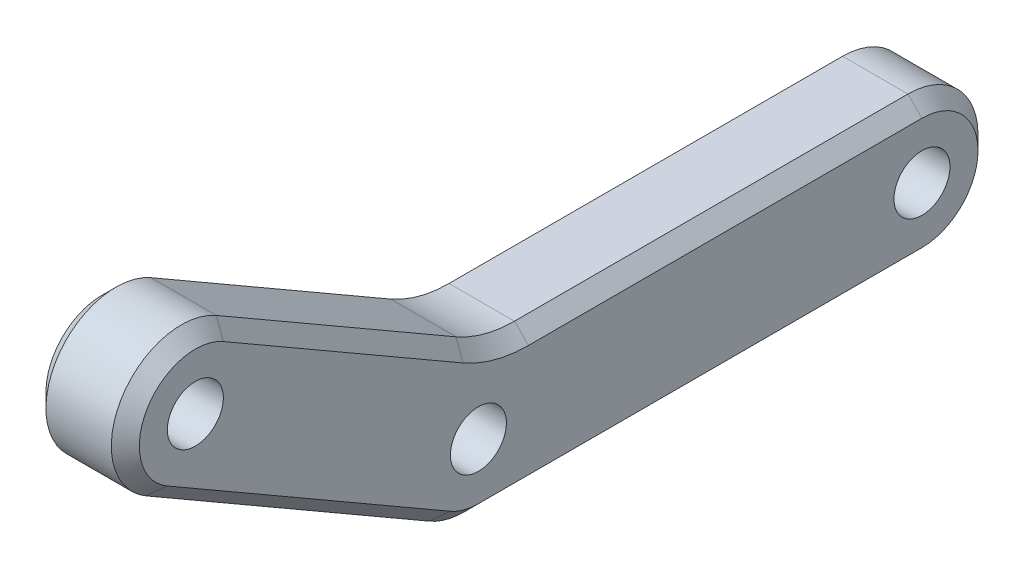
ISO-10303-21;
HEADER;
FILE_DESCRIPTION(('STEP AP214'),'2;1');
FILE_NAME('part.step','',(''),(''),'','','');
FILE_SCHEMA(('AUTOMOTIVE_DESIGN { 1 0 10303 214 1 1 1 1 }'));
ENDSEC;
DATA;
#1=APPLICATION_CONTEXT('core data for automotive mechanical design processes');
#2=APPLICATION_PROTOCOL_DEFINITION('international standard','automotive_design',2000,#1);
#3=PRODUCT_CONTEXT('',#1,'mechanical');
#4=PRODUCT('Part','Part','',(#3));
#5=PRODUCT_RELATED_PRODUCT_CATEGORY('part','',(#4));
#6=PRODUCT_DEFINITION_FORMATION('','',#4);
#7=PRODUCT_DEFINITION_CONTEXT('part definition',#1,'design');
#8=PRODUCT_DEFINITION('design','',#6,#7);
#9=PRODUCT_DEFINITION_SHAPE('','',#8);
#10=(LENGTH_UNIT() NAMED_UNIT(*) SI_UNIT(.MILLI.,.METRE.));
#11=(NAMED_UNIT(*) PLANE_ANGLE_UNIT() SI_UNIT($,.RADIAN.));
#12=(NAMED_UNIT(*) SI_UNIT($,.STERADIAN.) SOLID_ANGLE_UNIT());
#13=UNCERTAINTY_MEASURE_WITH_UNIT(LENGTH_MEASURE(1.E-05),#10,'distance_accuracy_value','');
#14=(GEOMETRIC_REPRESENTATION_CONTEXT(3) GLOBAL_UNCERTAINTY_ASSIGNED_CONTEXT((#13)) GLOBAL_UNIT_ASSIGNED_CONTEXT((#10,
#11,#12)) REPRESENTATION_CONTEXT('',''));
#15=CARTESIAN_POINT('',(0.,0.,0.));
#16=DIRECTION('',(0.,0.,1.));
#17=DIRECTION('',(1.,0.,0.));
#18=AXIS2_PLACEMENT_3D('',#15,#16,#17);
#19=CARTESIAN_POINT('',(2.,0.,0.));
#20=DIRECTION('',(-1.,0.,0.));
#21=DIRECTION('',(0.,0.,1.));
#22=AXIS2_PLACEMENT_3D('',#19,#20,#21);
#23=PLANE('',#22);
#24=CARTESIAN_POINT('',(2.,7.,12.1243556529821));
#25=DIRECTION('',(-1.,0.,0.));
#26=DIRECTION('',(0.,0.,1.));
#27=AXIS2_PLACEMENT_3D('',#24,#25,#26);
#28=CIRCLE('',#27,2.40000000000001);
#29=CARTESIAN_POINT('',(2.,9.07846096908267,10.9243556529821));
#30=VERTEX_POINT('',#29);
#31=CARTESIAN_POINT('',(2.,4.92153903091734,13.3243556529821));
#32=VERTEX_POINT('',#31);
#33=EDGE_CURVE('E125',#30,#32,#28,.F.);
#34=ORIENTED_EDGE('',*,*,#33,.T.);
#35=DIRECTION('',(0.,-0.5,-0.866025403784439));
#36=VECTOR('',#35,1.);
#37=CARTESIAN_POINT('',(2.,-2.07846096908265,1.19999999999999));
#38=LINE('',#37,#36);
#39=CARTESIAN_POINT('',(2.,-2.07846096908265,1.2));
#40=VERTEX_POINT('',#39);
#41=EDGE_CURVE('E12',#32,#40,#38,.T.);
#42=ORIENTED_EDGE('',*,*,#41,.T.);
#43=CARTESIAN_POINT('',(2.,0.,0.));
#44=DIRECTION('',(-1.,0.,0.));
#45=DIRECTION('',(0.,0.,1.));
#46=AXIS2_PLACEMENT_3D('',#43,#44,#45);
#47=CIRCLE('',#46,2.39999999999999);
#48=CARTESIAN_POINT('',(2.,-2.39999999999999,0.));
#49=VERTEX_POINT('',#48);
#50=EDGE_CURVE('E349',#40,#49,#47,.F.);
#51=ORIENTED_EDGE('',*,*,#50,.T.);
#52=DIRECTION('',(0.,0.,-1.));
#53=VECTOR('',#52,1.);
#54=CARTESIAN_POINT('',(2.,-2.39999999999999,-19.));
#55=LINE('',#54,#53);
#56=CARTESIAN_POINT('',(2.,-2.39999999999999,-19.));
#57=VERTEX_POINT('',#56);
#58=EDGE_CURVE('E345',#49,#57,#55,.T.);
#59=ORIENTED_EDGE('',*,*,#58,.T.);
#60=CARTESIAN_POINT('',(2.,0.,-19.));
#61=DIRECTION('',(-1.,0.,0.));
#62=DIRECTION('',(0.,0.,1.));
#63=AXIS2_PLACEMENT_3D('',#60,#61,#62);
#64=CIRCLE('',#63,2.39999999999999);
#65=CARTESIAN_POINT('',(2.,2.39999999999999,-19.));
#66=VERTEX_POINT('',#65);
#67=EDGE_CURVE('E341',#57,#66,#64,.F.);
#68=ORIENTED_EDGE('',*,*,#67,.T.);
#69=DIRECTION('',(0.,0.,1.));
#70=VECTOR('',#69,1.);
#71=CARTESIAN_POINT('',(2.,2.39999999999999,-2.14359353944899));
#72=LINE('',#71,#70);
#73=CARTESIAN_POINT('',(2.,2.39999999999999,-2.14359353944899));
#74=VERTEX_POINT('',#73);
#75=EDGE_CURVE('E339',#66,#74,#72,.T.);
#76=ORIENTED_EDGE('',*,*,#75,.T.);
#77=CARTESIAN_POINT('',(2.,8.,-2.14359353944899));
#78=DIRECTION('',(-1.,0.,0.));
#79=DIRECTION('',(0.,0.,1.));
#80=AXIS2_PLACEMENT_3D('',#77,#78,#79);
#81=CIRCLE('',#80,5.60000000000001);
#82=CARTESIAN_POINT('',(2.,3.15025773880714,0.656406460551025));
#83=VERTEX_POINT('',#82);
#84=EDGE_CURVE('E343',#74,#83,#81,.T.);
#85=ORIENTED_EDGE('',*,*,#84,.T.);
#86=DIRECTION('',(0.,0.500000000000002,0.866025403784438));
#87=VECTOR('',#86,1.);
#88=CARTESIAN_POINT('',(2.,9.07846096908267,10.9243556529821));
#89=LINE('',#88,#87);
#90=EDGE_CURVE('E347',#83,#30,#89,.T.);
#91=ORIENTED_EDGE('',*,*,#90,.T.);
#92=EDGE_LOOP('',(#34,#42,#51,#59,#68,#76,#85,#91));
#93=FACE_BOUND('',#92,.T.);
#94=CARTESIAN_POINT('',(2.,0.,0.));
#95=DIRECTION('',(1.,0.,0.));
#96=DIRECTION('',(0.,0.,-1.));
#97=AXIS2_PLACEMENT_3D('',#94,#95,#96);
#98=CIRCLE('',#97,1.2);
#99=CARTESIAN_POINT('',(2.,0.,-1.2));
#100=VERTEX_POINT('',#99);
#101=EDGE_CURVE('E395',#100,#100,#98,.T.);
#102=ORIENTED_EDGE('',*,*,#101,.F.);
#103=EDGE_LOOP('',(#102));
#104=FACE_BOUND('',#103,.T.);
#105=CARTESIAN_POINT('',(2.,0.,-19.));
#106=DIRECTION('',(1.,0.,0.));
#107=DIRECTION('',(0.,0.,-1.));
#108=AXIS2_PLACEMENT_3D('',#105,#106,#107);
#109=CIRCLE('',#108,1.2);
#110=CARTESIAN_POINT('',(2.,0.,-20.2));
#111=VERTEX_POINT('',#110);
#112=EDGE_CURVE('E411',#111,#111,#109,.T.);
#113=ORIENTED_EDGE('',*,*,#112,.F.);
#114=EDGE_LOOP('',(#113));
#115=FACE_BOUND('',#114,.T.);
#116=CARTESIAN_POINT('',(2.,7.,12.1243556529821));
#117=DIRECTION('',(1.,0.,0.));
#118=DIRECTION('',(0.,0.,-1.));
#119=AXIS2_PLACEMENT_3D('',#116,#117,#118);
#120=CIRCLE('',#119,1.2);
#121=CARTESIAN_POINT('',(2.,7.,10.9243556529821));
#122=VERTEX_POINT('',#121);
#123=EDGE_CURVE('E417',#122,#122,#120,.T.);
#124=ORIENTED_EDGE('',*,*,#123,.F.);
#125=EDGE_LOOP('',(#124));
#126=FACE_BOUND('',#125,.T.);
#127=ADVANCED_FACE('F115',(#93,#104,#115,#126),#23,.F.);
#128=CARTESIAN_POINT('',(-2.,0.,0.));
#129=DIRECTION('',(-1.,0.,0.));
#130=DIRECTION('',(0.,0.,1.));
#131=AXIS2_PLACEMENT_3D('',#128,#129,#130);
#132=PLANE('',#131);
#133=CARTESIAN_POINT('',(-2.,0.,0.));
#134=DIRECTION('',(-1.,0.,0.));
#135=DIRECTION('',(0.,0.,1.));
#136=AXIS2_PLACEMENT_3D('',#133,#134,#135);
#137=CIRCLE('',#136,2.4);
#138=CARTESIAN_POINT('',(-2.,-2.4,0.));
#139=VERTEX_POINT('',#138);
#140=CARTESIAN_POINT('',(-2.,-2.07846096908265,1.2));
#141=VERTEX_POINT('',#140);
#142=EDGE_CURVE('E382',#139,#141,#137,.T.);
#143=ORIENTED_EDGE('',*,*,#142,.T.);
#144=DIRECTION('',(0.,0.5,0.866025403784439));
#145=VECTOR('',#144,1.);
#146=CARTESIAN_POINT('',(-2.,-2.07846096908265,1.2));
#147=LINE('',#146,#145);
#148=CARTESIAN_POINT('',(-2.,4.92153903091734,13.3243556529821));
#149=VERTEX_POINT('',#148);
#150=EDGE_CURVE('E377',#141,#149,#147,.T.);
#151=ORIENTED_EDGE('',*,*,#150,.T.);
#152=CARTESIAN_POINT('',(-2.,7.,12.1243556529821));
#153=DIRECTION('',(-1.,0.,0.));
#154=DIRECTION('',(0.,0.,1.));
#155=AXIS2_PLACEMENT_3D('',#152,#153,#154);
#156=CIRCLE('',#155,2.40000000000001);
#157=CARTESIAN_POINT('',(-2.,9.07846096908268,10.9243556529821));
#158=VERTEX_POINT('',#157);
#159=EDGE_CURVE('E380',#149,#158,#156,.T.);
#160=ORIENTED_EDGE('',*,*,#159,.T.);
#161=DIRECTION('',(0.,-0.500000000000002,-0.866025403784438));
#162=VECTOR('',#161,1.);
#163=CARTESIAN_POINT('',(-2.,2.07846096908265,-1.2));
#164=LINE('',#163,#162);
#165=CARTESIAN_POINT('',(-2.,3.15025773880715,0.656406460551022));
#166=VERTEX_POINT('',#165);
#167=EDGE_CURVE('E237',#158,#166,#164,.T.);
#168=ORIENTED_EDGE('',*,*,#167,.T.);
#169=CARTESIAN_POINT('',(-2.,8.,-2.14359353944899));
#170=DIRECTION('',(-1.,0.,0.));
#171=DIRECTION('',(0.,0.,1.));
#172=AXIS2_PLACEMENT_3D('',#169,#170,#171);
#173=CIRCLE('',#172,5.6);
#174=CARTESIAN_POINT('',(-2.,2.4,-2.14359353944899));
#175=VERTEX_POINT('',#174);
#176=EDGE_CURVE('E230',#166,#175,#173,.F.);
#177=ORIENTED_EDGE('',*,*,#176,.T.);
#178=DIRECTION('',(0.,0.,-1.));
#179=VECTOR('',#178,1.);
#180=CARTESIAN_POINT('',(-2.,2.4,0.));
#181=LINE('',#180,#179);
#182=CARTESIAN_POINT('',(-2.,2.4,-19.));
#183=VERTEX_POINT('',#182);
#184=EDGE_CURVE('E234',#175,#183,#181,.T.);
#185=ORIENTED_EDGE('',*,*,#184,.T.);
#186=CARTESIAN_POINT('',(-2.,0.,-19.));
#187=DIRECTION('',(-1.,0.,0.));
#188=DIRECTION('',(0.,0.,1.));
#189=AXIS2_PLACEMENT_3D('',#186,#187,#188);
#190=CIRCLE('',#189,2.4);
#191=CARTESIAN_POINT('',(-2.,-2.4,-19.));
#192=VERTEX_POINT('',#191);
#193=EDGE_CURVE('E243',#183,#192,#190,.T.);
#194=ORIENTED_EDGE('',*,*,#193,.T.);
#195=DIRECTION('',(0.,0.,1.));
#196=VECTOR('',#195,1.);
#197=CARTESIAN_POINT('',(-2.,-2.4,0.));
#198=LINE('',#197,#196);
#199=EDGE_CURVE('E242',#192,#139,#198,.T.);
#200=ORIENTED_EDGE('',*,*,#199,.T.);
#201=EDGE_LOOP('',(#143,#151,#160,#168,#177,#185,#194,#200));
#202=FACE_BOUND('',#201,.T.);
#203=CARTESIAN_POINT('',(-2.,0.,-19.));
#204=DIRECTION('',(1.,0.,0.));
#205=DIRECTION('',(0.,0.,-1.));
#206=AXIS2_PLACEMENT_3D('',#203,#204,#205);
#207=CIRCLE('',#206,1.2);
#208=CARTESIAN_POINT('',(-2.,0.,-20.2));
#209=VERTEX_POINT('',#208);
#210=EDGE_CURVE('E414',#209,#209,#207,.T.);
#211=ORIENTED_EDGE('',*,*,#210,.T.);
#212=EDGE_LOOP('',(#211));
#213=FACE_BOUND('',#212,.T.);
#214=CARTESIAN_POINT('',(-2.,0.,0.));
#215=DIRECTION('',(1.,0.,0.));
#216=DIRECTION('',(0.,0.,-1.));
#217=AXIS2_PLACEMENT_3D('',#214,#215,#216);
#218=CIRCLE('',#217,1.2);
#219=CARTESIAN_POINT('',(-2.,0.,-1.2));
#220=VERTEX_POINT('',#219);
#221=EDGE_CURVE('E408',#220,#220,#218,.T.);
#222=ORIENTED_EDGE('',*,*,#221,.T.);
#223=EDGE_LOOP('',(#222));
#224=FACE_BOUND('',#223,.T.);
#225=CARTESIAN_POINT('',(-2.,7.,12.1243556529821));
#226=DIRECTION('',(1.,0.,0.));
#227=DIRECTION('',(0.,0.,-1.));
#228=AXIS2_PLACEMENT_3D('',#225,#226,#227);
#229=CIRCLE('',#228,1.2);
#230=CARTESIAN_POINT('',(-2.,7.,10.9243556529821));
#231=VERTEX_POINT('',#230);
#232=EDGE_CURVE('E260',#231,#231,#229,.T.);
#233=ORIENTED_EDGE('',*,*,#232,.T.);
#234=EDGE_LOOP('',(#233));
#235=FACE_BOUND('',#234,.T.);
#236=ADVANCED_FACE('F232',(#202,#213,#224,#235),#132,.T.);
#237=CARTESIAN_POINT('',(2.,0.,0.));
#238=DIRECTION('',(-1.,0.,0.));
#239=DIRECTION('',(0.,0.,1.));
#240=AXIS2_PLACEMENT_3D('',#237,#238,#239);
#241=CYLINDRICAL_SURFACE('',#240,3.);
#242=DIRECTION('',(-1.,0.,0.));
#243=VECTOR('',#242,1.);
#244=CARTESIAN_POINT('',(2.,-2.59807621135332,1.5));
#245=LINE('',#244,#243);
#246=CARTESIAN_POINT('',(1.39999999999999,-2.59807621135332,1.5));
#247=VERTEX_POINT('',#246);
#248=CARTESIAN_POINT('',(-1.4,-2.59807621135332,1.5));
#249=VERTEX_POINT('',#248);
#250=EDGE_CURVE('E392',#247,#249,#245,.T.);
#251=ORIENTED_EDGE('',*,*,#250,.T.);
#252=CARTESIAN_POINT('',(-1.4,0.,0.));
#253=DIRECTION('',(-1.,0.,0.));
#254=DIRECTION('',(0.,0.,1.));
#255=AXIS2_PLACEMENT_3D('',#252,#253,#254);
#256=CIRCLE('',#255,3.);
#257=CARTESIAN_POINT('',(-1.4,-3.,0.));
#258=VERTEX_POINT('',#257);
#259=EDGE_CURVE('E323',#249,#258,#256,.F.);
#260=ORIENTED_EDGE('',*,*,#259,.T.);
#261=DIRECTION('',(-1.,0.,0.));
#262=VECTOR('',#261,1.);
#263=CARTESIAN_POINT('',(2.,-3.,0.));
#264=LINE('',#263,#262);
#265=CARTESIAN_POINT('',(1.39999999999999,-3.,0.));
#266=VERTEX_POINT('',#265);
#267=EDGE_CURVE('E391',#266,#258,#264,.T.);
#268=ORIENTED_EDGE('',*,*,#267,.F.);
#269=CARTESIAN_POINT('',(1.39999999999999,0.,0.));
#270=DIRECTION('',(-1.,0.,0.));
#271=DIRECTION('',(0.,0.,1.));
#272=AXIS2_PLACEMENT_3D('',#269,#270,#271);
#273=CIRCLE('',#272,3.);
#274=EDGE_CURVE('E360',#266,#247,#273,.T.);
#275=ORIENTED_EDGE('',*,*,#274,.T.);
#276=EDGE_LOOP('',(#251,#260,#268,#275));
#277=FACE_BOUND('',#276,.T.);
#278=ADVANCED_FACE('F433',(#277),#241,.T.);
#279=CARTESIAN_POINT('',(2.,-3.,-19.));
#280=DIRECTION('',(0.,-1.,0.));
#281=DIRECTION('',(0.,0.,-1.));
#282=AXIS2_PLACEMENT_3D('',#279,#280,#281);
#283=PLANE('',#282);
#284=ORIENTED_EDGE('',*,*,#267,.T.);
#285=DIRECTION('',(0.,0.,-1.));
#286=VECTOR('',#285,1.);
#287=CARTESIAN_POINT('',(-1.4,-3.,-19.));
#288=LINE('',#287,#286);
#289=CARTESIAN_POINT('',(-1.4,-3.,-19.));
#290=VERTEX_POINT('',#289);
#291=EDGE_CURVE('E321',#258,#290,#288,.T.);
#292=ORIENTED_EDGE('',*,*,#291,.T.);
#293=DIRECTION('',(-1.,0.,0.));
#294=VECTOR('',#293,1.);
#295=CARTESIAN_POINT('',(2.,-3.,-19.));
#296=LINE('',#295,#294);
#297=CARTESIAN_POINT('',(1.39999999999999,-3.,-19.));
#298=VERTEX_POINT('',#297);
#299=EDGE_CURVE('E403',#298,#290,#296,.T.);
#300=ORIENTED_EDGE('',*,*,#299,.F.);
#301=DIRECTION('',(0.,0.,1.));
#302=VECTOR('',#301,1.);
#303=CARTESIAN_POINT('',(1.39999999999999,-3.,0.));
#304=LINE('',#303,#302);
#305=EDGE_CURVE('E318',#298,#266,#304,.T.);
#306=ORIENTED_EDGE('',*,*,#305,.T.);
#307=EDGE_LOOP('',(#284,#292,#300,#306));
#308=FACE_BOUND('',#307,.T.);
#309=ADVANCED_FACE('F439',(#308),#283,.T.);
#310=CARTESIAN_POINT('',(2.,0.,-19.));
#311=DIRECTION('',(-1.,0.,0.));
#312=DIRECTION('',(0.,0.,1.));
#313=AXIS2_PLACEMENT_3D('',#310,#311,#312);
#314=CYLINDRICAL_SURFACE('',#313,3.);
#315=ORIENTED_EDGE('',*,*,#299,.T.);
#316=CARTESIAN_POINT('',(-1.4,0.,-19.));
#317=DIRECTION('',(-1.,0.,0.));
#318=DIRECTION('',(0.,0.,1.));
#319=AXIS2_PLACEMENT_3D('',#316,#317,#318);
#320=CIRCLE('',#319,3.);
#321=CARTESIAN_POINT('',(-1.4,3.,-19.));
#322=VERTEX_POINT('',#321);
#323=EDGE_CURVE('E333',#290,#322,#320,.F.);
#324=ORIENTED_EDGE('',*,*,#323,.T.);
#325=DIRECTION('',(-1.,0.,0.));
#326=VECTOR('',#325,1.);
#327=CARTESIAN_POINT('',(2.,3.,-19.));
#328=LINE('',#327,#326);
#329=CARTESIAN_POINT('',(1.39999999999999,3.,-19.));
#330=VERTEX_POINT('',#329);
#331=EDGE_CURVE('E400',#330,#322,#328,.T.);
#332=ORIENTED_EDGE('',*,*,#331,.F.);
#333=CARTESIAN_POINT('',(1.39999999999999,0.,-19.));
#334=DIRECTION('',(-1.,0.,0.));
#335=DIRECTION('',(0.,0.,1.));
#336=AXIS2_PLACEMENT_3D('',#333,#334,#335);
#337=CIRCLE('',#336,3.);
#338=EDGE_CURVE('E331',#330,#298,#337,.T.);
#339=ORIENTED_EDGE('',*,*,#338,.T.);
#340=EDGE_LOOP('',(#315,#324,#332,#339));
#341=FACE_BOUND('',#340,.T.);
#342=ADVANCED_FACE('F442',(#341),#314,.T.);
#343=CARTESIAN_POINT('',(2.,3.,-0.803847577293369));
#344=DIRECTION('',(0.,1.,0.));
#345=DIRECTION('',(0.,0.,1.));
#346=AXIS2_PLACEMENT_3D('',#343,#344,#345);
#347=PLANE('',#346);
#348=ORIENTED_EDGE('',*,*,#331,.T.);
#349=DIRECTION('',(0.,0.,1.));
#350=VECTOR('',#349,1.);
#351=CARTESIAN_POINT('',(-1.4,3.,-0.803847577293369));
#352=LINE('',#351,#350);
#353=CARTESIAN_POINT('',(-1.4,3.,-2.14359353944899));
#354=VERTEX_POINT('',#353);
#355=EDGE_CURVE('E337',#322,#354,#352,.T.);
#356=ORIENTED_EDGE('',*,*,#355,.T.);
#357=DIRECTION('',(-1.,0.,0.));
#358=VECTOR('',#357,1.);
#359=CARTESIAN_POINT('',(2.,3.,-2.14359353944899));
#360=LINE('',#359,#358);
#361=CARTESIAN_POINT('',(1.39999999999999,3.,-2.14359353944899));
#362=VERTEX_POINT('',#361);
#363=EDGE_CURVE('E254',#354,#362,#360,.F.);
#364=ORIENTED_EDGE('',*,*,#363,.T.);
#365=DIRECTION('',(0.,0.,-1.));
#366=VECTOR('',#365,1.);
#367=CARTESIAN_POINT('',(1.39999999999999,3.,-19.));
#368=LINE('',#367,#366);
#369=EDGE_CURVE('E335',#362,#330,#368,.T.);
#370=ORIENTED_EDGE('',*,*,#369,.T.);
#371=EDGE_LOOP('',(#348,#356,#364,#370));
#372=FACE_BOUND('',#371,.T.);
#373=ADVANCED_FACE('F446',(#372),#347,.T.);
#374=CARTESIAN_POINT('',(2.,9.59807621135334,10.6243556529821));
#375=DIRECTION('',(0.,0.866025403784438,-0.500000000000002));
#376=DIRECTION('',(0.,0.500000000000002,0.866025403784438));
#377=AXIS2_PLACEMENT_3D('',#374,#375,#376);
#378=PLANE('',#377);
#379=DIRECTION('',(-1.,0.,0.));
#380=VECTOR('',#379,1.);
#381=CARTESIAN_POINT('',(-2.,3.66987298107781,0.356406460551021));
#382=LINE('',#381,#380);
#383=CARTESIAN_POINT('',(1.39999999999999,3.66987298107781,0.356406460551021));
#384=VERTEX_POINT('',#383);
#385=CARTESIAN_POINT('',(-1.4,3.66987298107781,0.356406460551021));
#386=VERTEX_POINT('',#385);
#387=EDGE_CURVE('E389',#384,#386,#382,.T.);
#388=ORIENTED_EDGE('',*,*,#387,.T.);
#389=DIRECTION('',(0.,0.500000000000002,0.866025403784438));
#390=VECTOR('',#389,1.);
#391=CARTESIAN_POINT('',(-1.4,9.59807621135334,10.6243556529821));
#392=LINE('',#391,#390);
#393=CARTESIAN_POINT('',(-1.4,9.59807621135333,10.6243556529821));
#394=VERTEX_POINT('',#393);
#395=EDGE_CURVE('E312',#386,#394,#392,.T.);
#396=ORIENTED_EDGE('',*,*,#395,.T.);
#397=DIRECTION('',(-1.,0.,0.));
#398=VECTOR('',#397,1.);
#399=CARTESIAN_POINT('',(2.,9.59807621135333,10.6243556529821));
#400=LINE('',#399,#398);
#401=CARTESIAN_POINT('',(1.39999999999999,9.59807621135333,10.6243556529821));
#402=VERTEX_POINT('',#401);
#403=EDGE_CURVE('E398',#402,#394,#400,.T.);
#404=ORIENTED_EDGE('',*,*,#403,.F.);
#405=DIRECTION('',(0.,-0.500000000000002,-0.866025403784438));
#406=VECTOR('',#405,1.);
#407=CARTESIAN_POINT('',(1.39999999999999,3.66987298107781,0.356406460551019));
#408=LINE('',#407,#406);
#409=EDGE_CURVE('E319',#402,#384,#408,.T.);
#410=ORIENTED_EDGE('',*,*,#409,.T.);
#411=EDGE_LOOP('',(#388,#396,#404,#410));
#412=FACE_BOUND('',#411,.T.);
#413=ADVANCED_FACE('F450',(#412),#378,.T.);
#414=CARTESIAN_POINT('',(2.,7.,12.1243556529821));
#415=DIRECTION('',(-1.,0.,0.));
#416=DIRECTION('',(0.,0.,1.));
#417=AXIS2_PLACEMENT_3D('',#414,#415,#416);
#418=CYLINDRICAL_SURFACE('',#417,3.00000000000001);
#419=ORIENTED_EDGE('',*,*,#403,.T.);
#420=CARTESIAN_POINT('',(-1.4,7.,12.1243556529821));
#421=DIRECTION('',(-1.,0.,0.));
#422=DIRECTION('',(0.,0.,1.));
#423=AXIS2_PLACEMENT_3D('',#420,#421,#422);
#424=CIRCLE('',#423,3.00000000000001);
#425=CARTESIAN_POINT('',(-1.4,4.40192378864669,13.6243556529821));
#426=VERTEX_POINT('',#425);
#427=EDGE_CURVE('E365',#394,#426,#424,.F.);
#428=ORIENTED_EDGE('',*,*,#427,.T.);
#429=DIRECTION('',(-1.,0.,0.));
#430=VECTOR('',#429,1.);
#431=CARTESIAN_POINT('',(2.,4.40192378864669,13.6243556529821));
#432=LINE('',#431,#430);
#433=CARTESIAN_POINT('',(1.39999999999999,4.40192378864669,13.6243556529821));
#434=VERTEX_POINT('',#433);
#435=EDGE_CURVE('E394',#434,#426,#432,.T.);
#436=ORIENTED_EDGE('',*,*,#435,.F.);
#437=CARTESIAN_POINT('',(1.39999999999999,7.,12.1243556529821));
#438=DIRECTION('',(-1.,0.,0.));
#439=DIRECTION('',(0.,0.,1.));
#440=AXIS2_PLACEMENT_3D('',#437,#438,#439);
#441=CIRCLE('',#440,3.00000000000001);
#442=EDGE_CURVE('E367',#434,#402,#441,.T.);
#443=ORIENTED_EDGE('',*,*,#442,.T.);
#444=EDGE_LOOP('',(#419,#428,#436,#443));
#445=FACE_BOUND('',#444,.T.);
#446=ADVANCED_FACE('F454',(#445),#418,.T.);
#447=CARTESIAN_POINT('',(2.,-2.59807621135332,1.5));
#448=DIRECTION('',(0.,-0.866025403784439,0.5));
#449=DIRECTION('',(0.,-0.5,-0.866025403784439));
#450=AXIS2_PLACEMENT_3D('',#447,#448,#449);
#451=PLANE('',#450);
#452=ORIENTED_EDGE('',*,*,#435,.T.);
#453=DIRECTION('',(0.,-0.5,-0.866025403784439));
#454=VECTOR('',#453,1.);
#455=CARTESIAN_POINT('',(-1.4,-2.59807621135332,1.5));
#456=LINE('',#455,#454);
#457=EDGE_CURVE('E371',#426,#249,#456,.T.);
#458=ORIENTED_EDGE('',*,*,#457,.T.);
#459=ORIENTED_EDGE('',*,*,#250,.F.);
#460=DIRECTION('',(0.,0.5,0.866025403784439));
#461=VECTOR('',#460,1.);
#462=CARTESIAN_POINT('',(1.4,4.40192378864669,13.6243556529821));
#463=LINE('',#462,#461);
#464=EDGE_CURVE('E374',#247,#434,#463,.T.);
#465=ORIENTED_EDGE('',*,*,#464,.T.);
#466=EDGE_LOOP('',(#452,#458,#459,#465));
#467=FACE_BOUND('',#466,.T.);
#468=ADVANCED_FACE('F457',(#467),#451,.T.);
#469=CARTESIAN_POINT('',(2.,0.,0.));
#470=DIRECTION('',(-1.,0.,0.));
#471=DIRECTION('',(0.,0.,1.));
#472=AXIS2_PLACEMENT_3D('',#469,#470,#471);
#473=CYLINDRICAL_SURFACE('',#472,1.2);
#474=ORIENTED_EDGE('',*,*,#101,.T.);
#475=EDGE_LOOP('',(#474));
#476=FACE_BOUND('',#475,.T.);
#477=ORIENTED_EDGE('',*,*,#221,.F.);
#478=EDGE_LOOP('',(#477));
#479=FACE_BOUND('',#478,.T.);
#480=ADVANCED_FACE('F436',(#476,#479),#473,.F.);
#481=CARTESIAN_POINT('',(2.,0.,-19.));
#482=DIRECTION('',(-1.,0.,0.));
#483=DIRECTION('',(0.,0.,1.));
#484=AXIS2_PLACEMENT_3D('',#481,#482,#483);
#485=CYLINDRICAL_SURFACE('',#484,1.2);
#486=ORIENTED_EDGE('',*,*,#112,.T.);
#487=EDGE_LOOP('',(#486));
#488=FACE_BOUND('',#487,.T.);
#489=ORIENTED_EDGE('',*,*,#210,.F.);
#490=EDGE_LOOP('',(#489));
#491=FACE_BOUND('',#490,.T.);
#492=ADVANCED_FACE('F627',(#488,#491),#485,.F.);
#493=CARTESIAN_POINT('',(2.,7.,12.1243556529821));
#494=DIRECTION('',(-1.,0.,0.));
#495=DIRECTION('',(0.,0.,1.));
#496=AXIS2_PLACEMENT_3D('',#493,#494,#495);
#497=CYLINDRICAL_SURFACE('',#496,1.2);
#498=ORIENTED_EDGE('',*,*,#123,.T.);
#499=EDGE_LOOP('',(#498));
#500=FACE_BOUND('',#499,.T.);
#501=ORIENTED_EDGE('',*,*,#232,.F.);
#502=EDGE_LOOP('',(#501));
#503=FACE_BOUND('',#502,.T.);
#504=ADVANCED_FACE('F425',(#500,#503),#497,.F.);
#505=CARTESIAN_POINT('',(2.,8.,-2.14359353944899));
#506=DIRECTION('',(1.,0.,0.));
#507=DIRECTION('',(0.,0.,-1.));
#508=AXIS2_PLACEMENT_3D('',#505,#506,#507);
#509=CYLINDRICAL_SURFACE('',#508,5.);
#510=ORIENTED_EDGE('',*,*,#363,.F.);
#511=CARTESIAN_POINT('',(-1.4,8.,-2.14359353944899));
#512=DIRECTION('',(-1.,0.,0.));
#513=DIRECTION('',(0.,0.,1.));
#514=AXIS2_PLACEMENT_3D('',#511,#512,#513);
#515=CIRCLE('',#514,5.);
#516=EDGE_CURVE('E257',#354,#386,#515,.T.);
#517=ORIENTED_EDGE('',*,*,#516,.T.);
#518=ORIENTED_EDGE('',*,*,#387,.F.);
#519=CARTESIAN_POINT('',(1.39999999999999,8.,-2.14359353944899));
#520=DIRECTION('',(-1.,0.,0.));
#521=DIRECTION('',(0.,0.,1.));
#522=AXIS2_PLACEMENT_3D('',#519,#520,#521);
#523=CIRCLE('',#522,5.);
#524=EDGE_CURVE('E328',#384,#362,#523,.F.);
#525=ORIENTED_EDGE('',*,*,#524,.T.);
#526=EDGE_LOOP('',(#510,#517,#518,#525));
#527=FACE_BOUND('',#526,.T.);
#528=ADVANCED_FACE('F464',(#527),#509,.F.);
#529=CARTESIAN_POINT('',(-2.,2.4,0.));
#530=DIRECTION('',(0.707106781186546,-0.70710678118655,0.));
#531=DIRECTION('',(0.,0.,-1.));
#532=AXIS2_PLACEMENT_3D('',#529,#530,#531);
#533=PLANE('',#532);
#534=DIRECTION('',(-0.70710678118655,-0.707106781186546,0.));
#535=VECTOR('',#534,1.);
#536=CARTESIAN_POINT('',(-1.4,3.,-2.14359353944899));
#537=LINE('',#536,#535);
#538=EDGE_CURVE('E249',#354,#175,#537,.T.);
#539=ORIENTED_EDGE('',*,*,#538,.F.);
#540=ORIENTED_EDGE('',*,*,#355,.F.);
#541=DIRECTION('',(0.70710678118655,0.707106781186546,0.));
#542=VECTOR('',#541,1.);
#543=CARTESIAN_POINT('',(-2.,2.4,-19.));
#544=LINE('',#543,#542);
#545=EDGE_CURVE('E252',#183,#322,#544,.T.);
#546=ORIENTED_EDGE('',*,*,#545,.F.);
#547=ORIENTED_EDGE('',*,*,#184,.F.);
#548=EDGE_LOOP('',(#539,#540,#546,#547));
#549=FACE_BOUND('',#548,.T.);
#550=ADVANCED_FACE('F247',(#549),#533,.F.);
#551=CARTESIAN_POINT('',(-2.,0.,-19.));
#552=DIRECTION('',(1.,0.,0.));
#553=DIRECTION('',(0.,0.,-1.));
#554=AXIS2_PLACEMENT_3D('',#551,#552,#553);
#555=CONICAL_SURFACE('',#554,2.4,0.785398163397445);
#556=ORIENTED_EDGE('',*,*,#545,.T.);
#557=ORIENTED_EDGE('',*,*,#323,.F.);
#558=DIRECTION('',(0.70710678118655,-0.707106781186546,0.));
#559=VECTOR('',#558,1.);
#560=CARTESIAN_POINT('',(-2.,-2.4,-19.));
#561=LINE('',#560,#559);
#562=EDGE_CURVE('E258',#192,#290,#561,.T.);
#563=ORIENTED_EDGE('',*,*,#562,.F.);
#564=ORIENTED_EDGE('',*,*,#193,.F.);
#565=EDGE_LOOP('',(#556,#557,#563,#564));
#566=FACE_BOUND('',#565,.T.);
#567=ADVANCED_FACE('F506',(#566),#555,.T.);
#568=CARTESIAN_POINT('',(-2.,8.,-2.14359353944899));
#569=DIRECTION('',(-1.,0.,0.));
#570=DIRECTION('',(0.,0.,1.));
#571=AXIS2_PLACEMENT_3D('',#568,#569,#570);
#572=CONICAL_SURFACE('',#571,5.6,0.785398163397445);
#573=ORIENTED_EDGE('',*,*,#538,.T.);
#574=ORIENTED_EDGE('',*,*,#176,.F.);
#575=DIRECTION('',(-0.70710678118655,-0.612372435695792,0.353553390593274));
#576=VECTOR('',#575,1.);
#577=CARTESIAN_POINT('',(-1.4,3.66987298107781,0.356406460551021));
#578=LINE('',#577,#576);
#579=EDGE_CURVE('E263',#386,#166,#578,.T.);
#580=ORIENTED_EDGE('',*,*,#579,.F.);
#581=ORIENTED_EDGE('',*,*,#516,.F.);
#582=EDGE_LOOP('',(#573,#574,#580,#581));
#583=FACE_BOUND('',#582,.T.);
#584=ADVANCED_FACE('F256',(#583),#572,.F.);
#585=CARTESIAN_POINT('',(-2.,-2.4,0.));
#586=DIRECTION('',(0.707106781186546,0.70710678118655,0.));
#587=DIRECTION('',(0.,0.,1.));
#588=AXIS2_PLACEMENT_3D('',#585,#586,#587);
#589=PLANE('',#588);
#590=ORIENTED_EDGE('',*,*,#562,.T.);
#591=ORIENTED_EDGE('',*,*,#291,.F.);
#592=DIRECTION('',(0.70710678118655,-0.707106781186546,0.));
#593=VECTOR('',#592,1.);
#594=CARTESIAN_POINT('',(-2.,-2.4,0.));
#595=LINE('',#594,#593);
#596=EDGE_CURVE('E306',#139,#258,#595,.T.);
#597=ORIENTED_EDGE('',*,*,#596,.F.);
#598=ORIENTED_EDGE('',*,*,#199,.F.);
#599=EDGE_LOOP('',(#590,#591,#597,#598));
#600=FACE_BOUND('',#599,.T.);
#601=ADVANCED_FACE('F494',(#600),#589,.F.);
#602=CARTESIAN_POINT('',(-2.,2.07846096908265,-1.2));
#603=DIRECTION('',(0.707106781186546,-0.612372435695795,0.353553390593276));
#604=DIRECTION('',(0.,-0.500000000000002,-0.866025403784438));
#605=AXIS2_PLACEMENT_3D('',#602,#603,#604);
#606=PLANE('',#605);
#607=ORIENTED_EDGE('',*,*,#579,.T.);
#608=ORIENTED_EDGE('',*,*,#167,.F.);
#609=DIRECTION('',(-0.707106781186549,-0.612372435695794,0.353553390593272));
#610=VECTOR('',#609,1.);
#611=CARTESIAN_POINT('',(-1.4,9.59807621135334,10.6243556529821));
#612=LINE('',#611,#610);
#613=EDGE_CURVE('E300',#394,#158,#612,.T.);
#614=ORIENTED_EDGE('',*,*,#613,.F.);
#615=ORIENTED_EDGE('',*,*,#395,.F.);
#616=EDGE_LOOP('',(#607,#608,#614,#615));
#617=FACE_BOUND('',#616,.T.);
#618=ADVANCED_FACE('F310',(#617),#606,.F.);
#619=CARTESIAN_POINT('',(-2.,0.,0.));
#620=DIRECTION('',(1.,0.,0.));
#621=DIRECTION('',(0.,0.,-1.));
#622=AXIS2_PLACEMENT_3D('',#619,#620,#621);
#623=CONICAL_SURFACE('',#622,2.4,0.785398163397445);
#624=ORIENTED_EDGE('',*,*,#596,.T.);
#625=ORIENTED_EDGE('',*,*,#259,.F.);
#626=DIRECTION('',(0.70710678118655,-0.612372435695793,0.353553390593273));
#627=VECTOR('',#626,1.);
#628=CARTESIAN_POINT('',(-2.,-2.07846096908265,1.2));
#629=LINE('',#628,#627);
#630=EDGE_CURVE('E293',#141,#249,#629,.T.);
#631=ORIENTED_EDGE('',*,*,#630,.F.);
#632=ORIENTED_EDGE('',*,*,#142,.F.);
#633=EDGE_LOOP('',(#624,#625,#631,#632));
#634=FACE_BOUND('',#633,.T.);
#635=ADVANCED_FACE('F481',(#634),#623,.T.);
#636=CARTESIAN_POINT('',(-2.,7.,12.1243556529821));
#637=DIRECTION('',(1.,0.,0.));
#638=DIRECTION('',(0.,0.,-1.));
#639=AXIS2_PLACEMENT_3D('',#636,#637,#638);
#640=CONICAL_SURFACE('',#639,2.40000000000001,0.785398163397446);
#641=ORIENTED_EDGE('',*,*,#613,.T.);
#642=ORIENTED_EDGE('',*,*,#159,.F.);
#643=DIRECTION('',(-0.70710678118655,0.612372435695792,-0.353553390593273));
#644=VECTOR('',#643,1.);
#645=CARTESIAN_POINT('',(-1.4,4.40192378864667,13.6243556529821));
#646=LINE('',#645,#644);
#647=EDGE_CURVE('E288',#426,#149,#646,.T.);
#648=ORIENTED_EDGE('',*,*,#647,.F.);
#649=ORIENTED_EDGE('',*,*,#427,.F.);
#650=EDGE_LOOP('',(#641,#642,#648,#649));
#651=FACE_BOUND('',#650,.T.);
#652=ADVANCED_FACE('F475',(#651),#640,.T.);
#653=CARTESIAN_POINT('',(-2.,-2.07846096908265,1.2));
#654=DIRECTION('',(0.707106781186545,0.612372435695796,-0.353553390593275));
#655=DIRECTION('',(0.,0.5,0.866025403784439));
#656=AXIS2_PLACEMENT_3D('',#653,#654,#655);
#657=PLANE('',#656);
#658=ORIENTED_EDGE('',*,*,#630,.T.);
#659=ORIENTED_EDGE('',*,*,#457,.F.);
#660=ORIENTED_EDGE('',*,*,#647,.T.);
#661=ORIENTED_EDGE('',*,*,#150,.F.);
#662=EDGE_LOOP('',(#658,#659,#660,#661));
#663=FACE_BOUND('',#662,.T.);
#664=ADVANCED_FACE('F469',(#663),#657,.F.);
#665=CARTESIAN_POINT('',(1.39999999999999,3.,-0.803847577293369));
#666=DIRECTION('',(0.707106781186547,0.707106781186547,0.));
#667=DIRECTION('',(0.,0.,1.));
#668=AXIS2_PLACEMENT_3D('',#665,#666,#667);
#669=PLANE('',#668);
#670=DIRECTION('',(-0.707106781186547,0.707106781186547,0.));
#671=VECTOR('',#670,1.);
#672=CARTESIAN_POINT('',(2.,2.39999999999999,-2.14359353944899));
#673=LINE('',#672,#671);
#674=EDGE_CURVE('E281',#74,#362,#673,.T.);
#675=ORIENTED_EDGE('',*,*,#674,.F.);
#676=ORIENTED_EDGE('',*,*,#75,.F.);
#677=DIRECTION('',(0.707106781186547,-0.707106781186547,0.));
#678=VECTOR('',#677,1.);
#679=CARTESIAN_POINT('',(1.39999999999999,3.,-19.));
#680=LINE('',#679,#678);
#681=EDGE_CURVE('E120',#330,#66,#680,.T.);
#682=ORIENTED_EDGE('',*,*,#681,.F.);
#683=ORIENTED_EDGE('',*,*,#369,.F.);
#684=EDGE_LOOP('',(#675,#676,#682,#683));
#685=FACE_BOUND('',#684,.T.);
#686=ADVANCED_FACE('F118',(#685),#669,.T.);
#687=CARTESIAN_POINT('',(1.39999999999999,0.,-19.));
#688=DIRECTION('',(-1.,0.,0.));
#689=DIRECTION('',(0.,0.,1.));
#690=AXIS2_PLACEMENT_3D('',#687,#688,#689);
#691=CONICAL_SURFACE('',#690,3.,0.785398163397448);
#692=ORIENTED_EDGE('',*,*,#681,.T.);
#693=ORIENTED_EDGE('',*,*,#67,.F.);
#694=DIRECTION('',(0.707106781186547,0.707106781186547,0.));
#695=VECTOR('',#694,1.);
#696=CARTESIAN_POINT('',(1.39999999999999,-3.,-19.));
#697=LINE('',#696,#695);
#698=EDGE_CURVE('E279',#298,#57,#697,.T.);
#699=ORIENTED_EDGE('',*,*,#698,.F.);
#700=ORIENTED_EDGE('',*,*,#338,.F.);
#701=EDGE_LOOP('',(#692,#693,#699,#700));
#702=FACE_BOUND('',#701,.T.);
#703=ADVANCED_FACE('F553',(#702),#691,.T.);
#704=CARTESIAN_POINT('',(2.,8.,-2.14359353944899));
#705=DIRECTION('',(1.,0.,0.));
#706=DIRECTION('',(0.,0.,-1.));
#707=AXIS2_PLACEMENT_3D('',#704,#705,#706);
#708=CONICAL_SURFACE('',#707,5.60000000000001,0.785398163397448);
#709=ORIENTED_EDGE('',*,*,#674,.T.);
#710=ORIENTED_EDGE('',*,*,#524,.F.);
#711=DIRECTION('',(-0.707106781186548,0.612372435695794,-0.353553390593275));
#712=VECTOR('',#711,1.);
#713=CARTESIAN_POINT('',(2.,3.15025773880714,0.656406460551025));
#714=LINE('',#713,#712);
#715=EDGE_CURVE('E276',#83,#384,#714,.T.);
#716=ORIENTED_EDGE('',*,*,#715,.F.);
#717=ORIENTED_EDGE('',*,*,#84,.F.);
#718=EDGE_LOOP('',(#709,#710,#716,#717));
#719=FACE_BOUND('',#718,.T.);
#720=ADVANCED_FACE('F548',(#719),#708,.F.);
#721=CARTESIAN_POINT('',(1.39999999999999,-3.,-19.));
#722=DIRECTION('',(0.707106781186547,-0.707106781186547,0.));
#723=DIRECTION('',(0.,0.,-1.));
#724=AXIS2_PLACEMENT_3D('',#721,#722,#723);
#725=PLANE('',#724);
#726=ORIENTED_EDGE('',*,*,#698,.T.);
#727=ORIENTED_EDGE('',*,*,#58,.F.);
#728=DIRECTION('',(0.707106781186547,0.707106781186547,0.));
#729=VECTOR('',#728,1.);
#730=CARTESIAN_POINT('',(1.39999999999999,-3.,0.));
#731=LINE('',#730,#729);
#732=EDGE_CURVE('E273',#266,#49,#731,.T.);
#733=ORIENTED_EDGE('',*,*,#732,.F.);
#734=ORIENTED_EDGE('',*,*,#305,.F.);
#735=EDGE_LOOP('',(#726,#727,#733,#734));
#736=FACE_BOUND('',#735,.T.);
#737=ADVANCED_FACE('F355',(#736),#725,.T.);
#738=CARTESIAN_POINT('',(1.39999999999999,9.59807621135334,10.6243556529821));
#739=DIRECTION('',(0.707106781186546,0.612372435695795,-0.353553390593276));
#740=DIRECTION('',(0.,0.500000000000002,0.866025403784438));
#741=AXIS2_PLACEMENT_3D('',#738,#739,#740);
#742=PLANE('',#741);
#743=ORIENTED_EDGE('',*,*,#715,.T.);
#744=ORIENTED_EDGE('',*,*,#409,.F.);
#745=DIRECTION('',(-0.707106781186548,0.612372435695794,-0.353553390593274));
#746=VECTOR('',#745,1.);
#747=CARTESIAN_POINT('',(2.,9.07846096908267,10.9243556529821));
#748=LINE('',#747,#746);
#749=EDGE_CURVE('E270',#30,#402,#748,.T.);
#750=ORIENTED_EDGE('',*,*,#749,.F.);
#751=ORIENTED_EDGE('',*,*,#90,.F.);
#752=EDGE_LOOP('',(#743,#744,#750,#751));
#753=FACE_BOUND('',#752,.T.);
#754=ADVANCED_FACE('F536',(#753),#742,.T.);
#755=CARTESIAN_POINT('',(1.39999999999999,0.,0.));
#756=DIRECTION('',(-1.,0.,0.));
#757=DIRECTION('',(0.,0.,1.));
#758=AXIS2_PLACEMENT_3D('',#755,#756,#757);
#759=CONICAL_SURFACE('',#758,3.,0.785398163397448);
#760=ORIENTED_EDGE('',*,*,#732,.T.);
#761=ORIENTED_EDGE('',*,*,#50,.F.);
#762=DIRECTION('',(0.707106781186548,0.612372435695795,-0.353553390593274));
#763=VECTOR('',#762,1.);
#764=CARTESIAN_POINT('',(1.39999999999999,-2.59807621135332,1.5));
#765=LINE('',#764,#763);
#766=EDGE_CURVE('E138',#247,#40,#765,.T.);
#767=ORIENTED_EDGE('',*,*,#766,.F.);
#768=ORIENTED_EDGE('',*,*,#274,.F.);
#769=EDGE_LOOP('',(#760,#761,#767,#768));
#770=FACE_BOUND('',#769,.T.);
#771=ADVANCED_FACE('F359',(#770),#759,.T.);
#772=CARTESIAN_POINT('',(1.39999999999999,7.,12.1243556529821));
#773=DIRECTION('',(-1.,0.,0.));
#774=DIRECTION('',(0.,0.,1.));
#775=AXIS2_PLACEMENT_3D('',#772,#773,#774);
#776=CONICAL_SURFACE('',#775,3.00000000000001,0.785398163397449);
#777=ORIENTED_EDGE('',*,*,#749,.T.);
#778=ORIENTED_EDGE('',*,*,#442,.F.);
#779=DIRECTION('',(-0.707106781186548,-0.612372435695795,0.353553390593274));
#780=VECTOR('',#779,1.);
#781=CARTESIAN_POINT('',(2.,4.92153903091734,13.3243556529821));
#782=LINE('',#781,#780);
#783=EDGE_CURVE('E267',#32,#434,#782,.T.);
#784=ORIENTED_EDGE('',*,*,#783,.F.);
#785=ORIENTED_EDGE('',*,*,#33,.F.);
#786=EDGE_LOOP('',(#777,#778,#784,#785));
#787=FACE_BOUND('',#786,.T.);
#788=ADVANCED_FACE('F524',(#787),#776,.T.);
#789=CARTESIAN_POINT('',(1.39999999999999,-2.59807621135332,1.5));
#790=DIRECTION('',(0.707106781186548,-0.612372435695794,0.353553390593273));
#791=DIRECTION('',(0.,-0.5,-0.866025403784439));
#792=AXIS2_PLACEMENT_3D('',#789,#790,#791);
#793=PLANE('',#792);
#794=ORIENTED_EDGE('',*,*,#766,.T.);
#795=ORIENTED_EDGE('',*,*,#41,.F.);
#796=ORIENTED_EDGE('',*,*,#783,.T.);
#797=ORIENTED_EDGE('',*,*,#464,.F.);
#798=EDGE_LOOP('',(#794,#795,#796,#797));
#799=FACE_BOUND('',#798,.T.);
#800=ADVANCED_FACE('F518',(#799),#793,.T.);
#801=CLOSED_SHELL('',(#127,#236,#278,#309,#342,#373,#413,#446,#468,#480,#492,#504,#528,#550,
#567,#584,#601,#618,#635,#652,#664,#686,#703,#720,#737,#754,#771,#788,#800));
#802=MANIFOLD_SOLID_BREP('B2',#801);
#803=ADVANCED_BREP_SHAPE_REPRESENTATION('',(#18,#802),#14);
#804=SHAPE_DEFINITION_REPRESENTATION(#9,#803);
ENDSEC;
END-ISO-10303-21;
